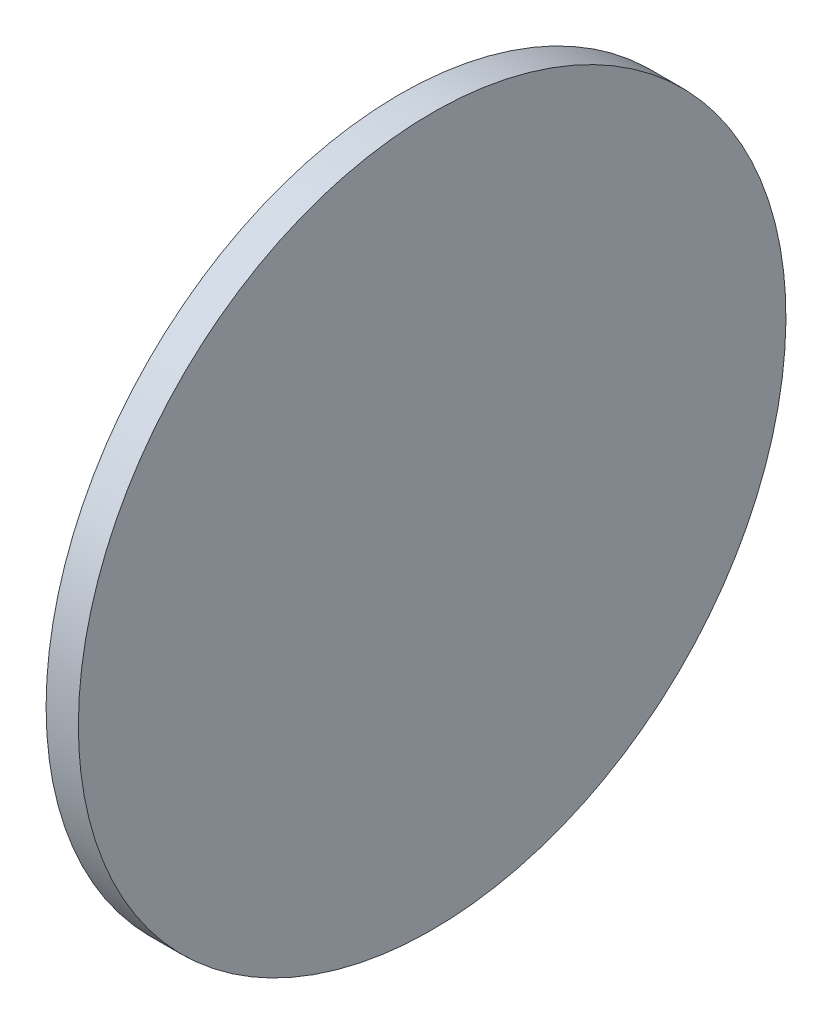
ISO-10303-21;
HEADER;
FILE_DESCRIPTION(('STEP AP214'),'2;1');
FILE_NAME('part.step','',(''),(''),'','','');
FILE_SCHEMA(('AUTOMOTIVE_DESIGN { 1 0 10303 214 1 1 1 1 }'));
ENDSEC;
DATA;
#1=APPLICATION_CONTEXT('core data for automotive mechanical design processes');
#2=APPLICATION_PROTOCOL_DEFINITION('international standard','automotive_design',2000,#1);
#3=PRODUCT_CONTEXT('',#1,'mechanical');
#4=PRODUCT('Part','Part','',(#3));
#5=PRODUCT_RELATED_PRODUCT_CATEGORY('part','',(#4));
#6=PRODUCT_DEFINITION_FORMATION('','',#4);
#7=PRODUCT_DEFINITION_CONTEXT('part definition',#1,'design');
#8=PRODUCT_DEFINITION('design','',#6,#7);
#9=PRODUCT_DEFINITION_SHAPE('','',#8);
#10=(LENGTH_UNIT() NAMED_UNIT(*) SI_UNIT(.MILLI.,.METRE.));
#11=(NAMED_UNIT(*) PLANE_ANGLE_UNIT() SI_UNIT($,.RADIAN.));
#12=(NAMED_UNIT(*) SI_UNIT($,.STERADIAN.) SOLID_ANGLE_UNIT());
#13=UNCERTAINTY_MEASURE_WITH_UNIT(LENGTH_MEASURE(1.E-05),#10,'distance_accuracy_value','');
#14=(GEOMETRIC_REPRESENTATION_CONTEXT(3) GLOBAL_UNCERTAINTY_ASSIGNED_CONTEXT((#13)) GLOBAL_UNIT_ASSIGNED_CONTEXT((#10,
#11,#12)) REPRESENTATION_CONTEXT('',''));
#15=CARTESIAN_POINT('',(0.,0.,0.));
#16=DIRECTION('',(0.,0.,1.));
#17=DIRECTION('',(1.,0.,0.));
#18=AXIS2_PLACEMENT_3D('',#15,#16,#17);
#19=CARTESIAN_POINT('',(-284.033268583936,22.6971380761825,594.411104985507));
#20=CARTESIAN_POINT('',(-284.033268583936,24.6488522827371,594.411104985507));
#21=CARTESIAN_POINT('',(-284.033268583936,28.5522806958463,594.026650843195));
#22=CARTESIAN_POINT('',(-284.033268583936,34.1824134682382,592.318768738421));
#23=CARTESIAN_POINT('',(-284.033268583936,39.3711735483301,589.545318693835));
#24=CARTESIAN_POINT('',(-284.033268583936,43.9191597961341,585.812882839282));
#25=CARTESIAN_POINT('',(-284.033268583936,47.6515956506874,581.264896591478));
#26=CARTESIAN_POINT('',(-284.033268583936,50.4250456952734,576.076136511386));
#27=CARTESIAN_POINT('',(-284.033268583936,52.1329278000475,570.446003738994));
#28=CARTESIAN_POINT('',(-284.033268583936,52.7096090135146,564.59086111933));
#29=CARTESIAN_POINT('',(-284.033268583936,52.1329278000475,558.735718499666));
#30=CARTESIAN_POINT('',(-284.033268583936,50.4250456952734,553.105585727274));
#31=CARTESIAN_POINT('',(-284.033268583936,47.6515956506874,547.916825647182));
#32=CARTESIAN_POINT('',(-284.033268583936,43.9191597961341,543.368839399378));
#33=CARTESIAN_POINT('',(-284.033268583936,39.3711735483301,539.636403544825));
#34=CARTESIAN_POINT('',(-284.033268583936,34.1824134682382,536.862953500239));
#35=CARTESIAN_POINT('',(-284.033268583936,28.5522806958463,535.155071395465));
#36=CARTESIAN_POINT('',(-284.033268583936,22.6971380761825,534.578390181998));
#37=CARTESIAN_POINT('',(-284.033268583936,16.8419954565187,535.155071395465));
#38=CARTESIAN_POINT('',(-284.033268583936,11.2118626841268,536.862953500239));
#39=CARTESIAN_POINT('',(-284.033268583936,6.02310260403487,539.636403544825));
#40=CARTESIAN_POINT('',(-284.033268583936,1.47511635623081,543.368839399378));
#41=CARTESIAN_POINT('',(-284.033268583936,-2.25731949832241,547.916825647182));
#42=CARTESIAN_POINT('',(-284.033268583936,-5.03076954290846,553.105585727274));
#43=CARTESIAN_POINT('',(-284.033268583936,-6.73865164768254,558.735718499666));
#44=CARTESIAN_POINT('',(-284.033268583936,-7.31533286114959,564.59086111933));
#45=CARTESIAN_POINT('',(-284.033268583936,-6.73865164768255,570.446003738994));
#46=CARTESIAN_POINT('',(-284.033268583936,-5.03076954290847,576.076136511386));
#47=CARTESIAN_POINT('',(-284.033268583936,-2.25731949832241,581.264896591478));
#48=CARTESIAN_POINT('',(-284.033268583936,1.4751163562308,585.812882839282));
#49=CARTESIAN_POINT('',(-284.033268583936,6.02310260403486,589.545318693835));
#50=CARTESIAN_POINT('',(-284.033268583936,11.2118626841268,592.318768738421));
#51=CARTESIAN_POINT('',(-284.033268583936,16.8419954565186,594.026650843195));
#52=CARTESIAN_POINT('',(-284.033268583936,20.7454238696279,594.411104985507));
#53=CARTESIAN_POINT('',(-284.033268583936,22.6971380761825,594.411104985507));
#54=B_SPLINE_CURVE_WITH_KNOTS('',3,(#19,#20,#21,#22,#23,#24,#25,#26,#27,#28,#29,#30,#31,#32,#33,
#34,#35,#36,#37,#38,#39,#40,#41,#42,#43,#44,#45,#46,#47,#48,#49,#50,#51,#52,#53),.UNSPECIFIED.,
.T.,.F.,(4,1,1,1,1,1,1,1,1,1,1,1,1,1,1,1,1,1,1,1,1,1,1,1,1,1,1,1,1,1,1,1,4),(0.,0.03125,
0.0625000000000001,0.09375,0.125,0.15625,0.1875,0.21875,0.25,0.28125,0.3125,0.34375,0.375,
0.40625,0.4375,0.46875,0.5,0.53125,0.5625,0.59375,0.625,0.65625,0.6875,0.71875,0.75,0.78125,
0.8125,0.84375,0.875,0.90625,0.9375,0.96875,1.),.UNSPECIFIED.);
#55=DIRECTION('',(-1.,0.,0.));
#56=VECTOR('',#55,1.);
#57=SURFACE_OF_LINEAR_EXTRUSION('',#54,#56);
#58=CARTESIAN_POINT('',(-284.033268583936,22.6971380761825,594.411104985507));
#59=CARTESIAN_POINT('',(-284.033268583936,24.6488522827371,594.411104985507));
#60=CARTESIAN_POINT('',(-284.033268583936,28.5522806958463,594.026650843195));
#61=CARTESIAN_POINT('',(-284.033268583936,34.1824134682382,592.318768738421));
#62=CARTESIAN_POINT('',(-284.033268583936,39.3711735483301,589.545318693835));
#63=CARTESIAN_POINT('',(-284.033268583936,43.9191597961341,585.812882839282));
#64=CARTESIAN_POINT('',(-284.033268583936,47.6515956506874,581.264896591478));
#65=CARTESIAN_POINT('',(-284.033268583936,50.4250456952734,576.076136511386));
#66=CARTESIAN_POINT('',(-284.033268583936,52.1329278000475,570.446003738994));
#67=CARTESIAN_POINT('',(-284.033268583936,52.7096090135146,564.59086111933));
#68=CARTESIAN_POINT('',(-284.033268583936,52.1329278000475,558.735718499666));
#69=CARTESIAN_POINT('',(-284.033268583936,50.4250456952734,553.105585727274));
#70=CARTESIAN_POINT('',(-284.033268583936,47.6515956506874,547.916825647182));
#71=CARTESIAN_POINT('',(-284.033268583936,43.9191597961341,543.368839399378));
#72=CARTESIAN_POINT('',(-284.033268583936,39.3711735483301,539.636403544825));
#73=CARTESIAN_POINT('',(-284.033268583936,34.1824134682382,536.862953500239));
#74=CARTESIAN_POINT('',(-284.033268583936,28.5522806958463,535.155071395465));
#75=CARTESIAN_POINT('',(-284.033268583936,22.6971380761825,534.578390181998));
#76=CARTESIAN_POINT('',(-284.033268583936,16.8419954565187,535.155071395465));
#77=CARTESIAN_POINT('',(-284.033268583936,11.2118626841268,536.862953500239));
#78=CARTESIAN_POINT('',(-284.033268583936,6.02310260403487,539.636403544825));
#79=CARTESIAN_POINT('',(-284.033268583936,1.47511635623081,543.368839399378));
#80=CARTESIAN_POINT('',(-284.033268583936,-2.25731949832241,547.916825647182));
#81=CARTESIAN_POINT('',(-284.033268583936,-5.03076954290846,553.105585727274));
#82=CARTESIAN_POINT('',(-284.033268583936,-6.73865164768254,558.735718499666));
#83=CARTESIAN_POINT('',(-284.033268583936,-7.31533286114959,564.59086111933));
#84=CARTESIAN_POINT('',(-284.033268583936,-6.73865164768255,570.446003738994));
#85=CARTESIAN_POINT('',(-284.033268583936,-5.03076954290847,576.076136511386));
#86=CARTESIAN_POINT('',(-284.033268583936,-2.25731949832241,581.264896591478));
#87=CARTESIAN_POINT('',(-284.033268583936,1.4751163562308,585.812882839282));
#88=CARTESIAN_POINT('',(-284.033268583936,6.02310260403486,589.545318693835));
#89=CARTESIAN_POINT('',(-284.033268583936,11.2118626841268,592.318768738421));
#90=CARTESIAN_POINT('',(-284.033268583936,16.8419954565186,594.026650843195));
#91=CARTESIAN_POINT('',(-284.033268583936,20.7454238696279,594.411104985507));
#92=CARTESIAN_POINT('',(-284.033268583936,22.6971380761825,594.411104985507));
#93=B_SPLINE_CURVE_WITH_KNOTS('',3,(#58,#59,#60,#61,#62,#63,#64,#65,#66,#67,#68,#69,#70,#71,#72,
#73,#74,#75,#76,#77,#78,#79,#80,#81,#82,#83,#84,#85,#86,#87,#88,#89,#90,#91,#92),.UNSPECIFIED.,
.T.,.F.,(4,1,1,1,1,1,1,1,1,1,1,1,1,1,1,1,1,1,1,1,1,1,1,1,1,1,1,1,1,1,1,1,4),(0.,0.03125,
0.0625000000000001,0.09375,0.125,0.15625,0.1875,0.21875,0.25,0.28125,0.3125,0.34375,0.375,
0.40625,0.4375,0.46875,0.5,0.53125,0.5625,0.59375,0.625,0.65625,0.6875,0.71875,0.75,0.78125,
0.8125,0.84375,0.875,0.90625,0.9375,0.96875,1.),.UNSPECIFIED.);
#94=CARTESIAN_POINT('',(-284.033268583936,22.6971380761825,594.411104985507));
#95=VERTEX_POINT('',#94);
#96=EDGE_CURVE('E9',#95,#95,#93,.T.);
#97=ORIENTED_EDGE('',*,*,#96,.T.);
#98=EDGE_LOOP('',(#97));
#99=FACE_BOUND('',#98,.T.);
#100=CARTESIAN_POINT('',(-286.754540547893,22.6971380761825,594.411104985507));
#101=CARTESIAN_POINT('',(-286.754540547893,22.209206528486,594.411104884299));
#102=CARTESIAN_POINT('',(-286.754540547892,21.7212785318932,594.39909065008));
#103=CARTESIAN_POINT('',(-286.754540547892,20.746594451324,594.351149407714));
#104=CARTESIAN_POINT('',(-286.754540547892,20.2598383764804,594.315222213816));
#105=CARTESIAN_POINT('',(-286.754540547892,19.2886705665238,594.219570547781));
#106=CARTESIAN_POINT('',(-286.754540547892,18.8042588314108,594.159846075645));
#107=CARTESIAN_POINT('',(-286.754540547892,17.8389491504251,594.016714552078));
#108=CARTESIAN_POINT('',(-286.754540547892,17.358051177287,593.933307684614));
#109=CARTESIAN_POINT('',(-286.754540547892,16.4009430181743,593.742927038007));
#110=CARTESIAN_POINT('',(-286.754540547892,15.9247328321996,593.635953258865));
#111=CARTESIAN_POINT('',(-286.754540547892,14.9781288439775,593.39878149562));
#112=CARTESIAN_POINT('',(-286.754540547892,14.5077350869397,593.26858333112));
#113=CARTESIAN_POINT('',(-286.754540547892,13.5738889928545,592.985304215865));
#114=CARTESIAN_POINT('',(-286.754540547892,13.1104366558071,592.83222326511));
#115=CARTESIAN_POINT('',(-286.754540547892,12.1915986284864,592.503519377936));
#116=CARTESIAN_POINT('',(-286.754540547892,11.7362128755807,592.32789661663));
#117=CARTESIAN_POINT('',(-286.754540547892,10.8346367234395,591.954451546941));
#118=CARTESIAN_POINT('',(-286.754540547892,10.388446324204,591.756629238558));
#119=CARTESIAN_POINT('',(-286.754540547892,9.50630097637825,591.339341385978));
#120=CARTESIAN_POINT('',(-286.754540547893,9.07034610732268,591.119875673671));
#121=CARTESIAN_POINT('',(-286.754540547893,8.20970861936342,590.659855352344));
#122=CARTESIAN_POINT('',(-286.754540547892,7.78502600045973,590.419300743324));
#123=CARTESIAN_POINT('',(-286.754540547892,6.94797013499261,589.917656402443));
#124=CARTESIAN_POINT('',(-286.754540547892,6.53559679283771,589.65656683011));
#125=CARTESIAN_POINT('',(-286.754540547892,5.72419969266131,589.114408620903));
#126=CARTESIAN_POINT('',(-286.754540547893,5.32517593463981,588.833339984029));
#127=CARTESIAN_POINT('',(-286.754540547893,4.54138958382109,588.251972180548));
#128=CARTESIAN_POINT('',(-286.754540547892,4.15662710182708,587.951672864578));
#129=CARTESIAN_POINT('',(-286.754540547892,3.40227203450267,587.332589660071));
#130=CARTESIAN_POINT('',(-286.754540547892,3.03267944917227,587.013805771534));
#131=CARTESIAN_POINT('',(-286.754540547892,2.30957333344485,586.35849888766));
#132=CARTESIAN_POINT('',(-286.754540547892,1.9560596781708,586.021976030138));
#133=CARTESIAN_POINT('',(-286.754540547892,1.26602316537438,585.331939517342));
#134=CARTESIAN_POINT('',(-286.754540547892,0.92950030785201,584.978425862068));
#135=CARTESIAN_POINT('',(-286.754540547892,0.274193423978801,584.25531974634));
#136=CARTESIAN_POINT('',(-286.754540547892,-0.044590464558481,583.88572716101));
#137=CARTESIAN_POINT('',(-286.754540547892,-0.663673669065746,583.131372093685));
#138=CARTESIAN_POINT('',(-286.754540547892,-0.963972985035729,582.746609611691));
#139=CARTESIAN_POINT('',(-286.754540547892,-1.54534078851652,581.962823260873));
#140=CARTESIAN_POINT('',(-286.754540547892,-1.82640942539097,581.563799502851));
#141=CARTESIAN_POINT('',(-286.754540547892,-2.36856763459814,580.752402402675));
#142=CARTESIAN_POINT('',(-286.754540547892,-2.62965720693085,580.340029060521));
#143=CARTESIAN_POINT('',(-286.754540547892,-3.13130154781153,579.502973195052));
#144=CARTESIAN_POINT('',(-286.754540547893,-3.37185615683169,579.078290576145));
#145=CARTESIAN_POINT('',(-286.754540547893,-3.83187647815844,578.217653088194));
#146=CARTESIAN_POINT('',(-286.754540547893,-4.05134219046503,577.781698219149));
#147=CARTESIAN_POINT('',(-286.754540547893,-4.46863004304626,576.899552871294));
#148=CARTESIAN_POINT('',(-286.754540547893,-4.6664523514312,576.453362472018));
#149=CARTESIAN_POINT('',(-286.754540547893,-5.0398974211151,575.551786319986));
#150=CARTESIAN_POINT('',(-286.754540547893,-5.21552018241406,575.096400567229));
#151=CARTESIAN_POINT('',(-286.754540547893,-5.54422406960752,574.177562539502));
#152=CARTESIAN_POINT('',(-286.754540547893,-5.69730502039051,573.714110201899));
#153=CARTESIAN_POINT('',(-286.754540547893,-5.98058413557056,572.780264109332));
#154=CARTESIAN_POINT('',(-286.754540547893,-6.11078229996761,572.309870354367));
#155=CARTESIAN_POINT('',(-286.754540547893,-6.3479540634923,571.363266360481));
#156=CARTESIAN_POINT('',(-286.754540547893,-6.4549278430165,570.88705616677));
#157=CARTESIAN_POINT('',(-286.754540547893,-6.64530848857959,569.929948028794));
#158=CARTESIAN_POINT('',(-286.754540547892,-6.72871535461848,569.44905008453));
#159=CARTESIAN_POINT('',(-286.754540547892,-6.87184688207915,568.483740324659));
#160=CARTESIAN_POINT('',(-286.754540547893,-6.93157135953518,567.999328481787));
#161=CARTESIAN_POINT('',(-286.754540547893,-7.02722301103691,567.028160966234));
#162=CARTESIAN_POINT('',(-286.754540547892,-7.06315018508261,566.541405293553));
#163=CARTESIAN_POINT('',(-286.754540547892,-7.11109148168596,565.566720114259));
#164=CARTESIAN_POINT('',(-286.754540547892,-7.12310578999391,565.078790616795));
#165=CARTESIAN_POINT('',(-286.754540547892,-7.12310578999391,564.102931621865));
#166=CARTESIAN_POINT('',(-286.754540547892,-7.11109148168596,563.615002124401));
#167=CARTESIAN_POINT('',(-286.754540547892,-7.06315018508261,562.640316945107));
#168=CARTESIAN_POINT('',(-286.754540547892,-7.02722301103691,562.153561272426));
#169=CARTESIAN_POINT('',(-286.754540547892,-6.93157135953518,561.182393756873));
#170=CARTESIAN_POINT('',(-286.754540547892,-6.87184688207915,560.697981914001));
#171=CARTESIAN_POINT('',(-286.754540547892,-6.72871535461848,559.73267215413));
#172=CARTESIAN_POINT('',(-286.754540547892,-6.64530848857958,559.251774209866));
#173=CARTESIAN_POINT('',(-286.754540547892,-6.45492784301649,558.29466607189));
#174=CARTESIAN_POINT('',(-286.754540547892,-6.34795406349228,557.818455878179));
#175=CARTESIAN_POINT('',(-286.754540547892,-6.1107822999676,556.871851884293));
#176=CARTESIAN_POINT('',(-286.754540547892,-5.98058413557056,556.401458129328));
#177=CARTESIAN_POINT('',(-286.754540547892,-5.69730502039051,555.467612036761));
#178=CARTESIAN_POINT('',(-286.754540547892,-5.5442240696075,555.004159699158));
#179=CARTESIAN_POINT('',(-286.754540547892,-5.21552018241404,554.085321671431));
#180=CARTESIAN_POINT('',(-286.754540547892,-5.03989742111507,553.629935918674));
#181=CARTESIAN_POINT('',(-286.754540547892,-4.6664523514312,552.728359766641));
#182=CARTESIAN_POINT('',(-286.754540547892,-4.46863004304629,552.282169367366));
#183=CARTESIAN_POINT('',(-286.754540547892,-4.05134219046503,551.400024019511));
#184=CARTESIAN_POINT('',(-286.754540547892,-3.8318764781584,550.964069150466));
#185=CARTESIAN_POINT('',(-286.754540547892,-3.37185615683165,550.103431662515));
#186=CARTESIAN_POINT('',(-286.754540547892,-3.13130154781152,549.678749043608));
#187=CARTESIAN_POINT('',(-286.754540547892,-2.62965720693086,548.841693178139));
#188=CARTESIAN_POINT('',(-286.754540547893,-2.36856763459813,548.429319835985));
#189=CARTESIAN_POINT('',(-286.754540547893,-1.82640942539096,547.617922735809));
#190=CARTESIAN_POINT('',(-286.754540547892,-1.54534078851652,547.218898977787));
#191=CARTESIAN_POINT('',(-286.754540547892,-0.963972985035716,546.435112626969));
#192=CARTESIAN_POINT('',(-286.754540547892,-0.663673669065712,546.050350144975));
#193=CARTESIAN_POINT('',(-286.754540547892,-0.0445904645584666,545.29599507765));
#194=CARTESIAN_POINT('',(-286.754540547892,0.274193423978776,544.92640249232));
#195=CARTESIAN_POINT('',(-286.754540547892,0.929500307851993,544.203296376592));
#196=CARTESIAN_POINT('',(-286.754540547892,1.26602316537441,543.849782721318));
#197=CARTESIAN_POINT('',(-286.754540547892,1.95605967817082,543.159746208522));
#198=CARTESIAN_POINT('',(-286.754540547892,2.30957333344482,542.823223350999));
#199=CARTESIAN_POINT('',(-286.754540547892,3.03267944917226,542.167916467126));
#200=CARTESIAN_POINT('',(-286.754540547892,3.40227203450272,541.849132578589));
#201=CARTESIAN_POINT('',(-286.754540547892,4.1566271018271,541.230049374082));
#202=CARTESIAN_POINT('',(-286.754540547893,4.54138958382102,540.929750058112));
#203=CARTESIAN_POINT('',(-286.754540547893,5.32517593463987,540.348382254631));
#204=CARTESIAN_POINT('',(-286.754540547893,5.7241996926616,540.067313617757));
#205=CARTESIAN_POINT('',(-286.754540547893,6.53559679283744,539.525155408549));
#206=CARTESIAN_POINT('',(-286.754540547893,6.94797013499156,539.264065836217));
#207=CARTESIAN_POINT('',(-286.754540547893,7.78502600046078,538.762421495336));
#208=CARTESIAN_POINT('',(-286.754540547893,8.20970861936735,538.521866886316));
#209=CARTESIAN_POINT('',(-286.754540547893,9.0703461073188,538.061846564989));
#210=CARTESIAN_POINT('',(-286.754540547892,9.50630097636368,537.842380852683));
#211=CARTESIAN_POINT('',(-286.754540547892,10.3884463242187,537.425093000101));
#212=CARTESIAN_POINT('',(-286.754540547892,10.834636723494,537.227270691716));
#213=CARTESIAN_POINT('',(-286.754540547892,11.7362128755262,536.853825622032));
#214=CARTESIAN_POINT('',(-286.754540547892,12.1915986282831,536.678202860733));
#215=CARTESIAN_POINT('',(-286.754540547892,13.1104366560105,536.34949897354));
#216=CARTESIAN_POINT('',(-286.754540547892,13.5738889936134,536.196418022757));
#217=CARTESIAN_POINT('',(-286.754540547892,14.5077350861809,535.913138907577));
#218=CARTESIAN_POINT('',(-286.754540547892,14.9781288411457,535.78294074318));
#219=CARTESIAN_POINT('',(-286.754540547892,15.9247328350315,535.545768979655));
#220=CARTESIAN_POINT('',(-286.754540547892,16.4009430287428,535.438795200131));
#221=CARTESIAN_POINT('',(-286.754540547892,17.3580511667186,535.248414554568));
#222=CARTESIAN_POINT('',(-286.754540547892,17.838949110983,535.165007688529));
#223=CARTESIAN_POINT('',(-286.754540547892,18.8042588708533,535.021876161068));
#224=CARTESIAN_POINT('',(-286.754540547892,19.2886707137254,534.962151683612));
#225=CARTESIAN_POINT('',(-286.754540547892,20.2598382292787,534.86650003211));
#226=CARTESIAN_POINT('',(-286.754540547892,20.7465939019599,534.830572858065));
#227=CARTESIAN_POINT('',(-286.754540547892,21.7212790812532,534.782631561462));
#228=CARTESIAN_POINT('',(-286.754540547892,22.2092085787178,534.770617253154));
#229=CARTESIAN_POINT('',(-286.754540547892,23.1850675736471,534.770617253154));
#230=CARTESIAN_POINT('',(-286.754540547892,23.6729970711118,534.782631561462));
#231=CARTESIAN_POINT('',(-286.754540547892,24.6476822504051,534.830572858065));
#232=CARTESIAN_POINT('',(-286.754540547893,25.1344379230863,534.86650003211));
#233=CARTESIAN_POINT('',(-286.754540547893,26.1056054386395,534.962151683612));
#234=CARTESIAN_POINT('',(-286.754540547893,26.5900172815117,535.021876161068));
#235=CARTESIAN_POINT('',(-286.754540547892,27.555327041382,535.165007688529));
#236=CARTESIAN_POINT('',(-286.754540547892,28.0362249856464,535.248414554568));
#237=CARTESIAN_POINT('',(-286.754540547892,28.9933331236222,535.438795200131));
#238=CARTESIAN_POINT('',(-286.754540547892,29.4695433173335,535.545768979655));
#239=CARTESIAN_POINT('',(-286.754540547892,30.4161473112193,535.78294074318));
#240=CARTESIAN_POINT('',(-286.754540547892,30.8865410661841,535.913138907577));
#241=CARTESIAN_POINT('',(-286.754540547892,31.8203871587516,536.196418022757));
#242=CARTESIAN_POINT('',(-286.754540547892,32.2838394963545,536.34949897354));
#243=CARTESIAN_POINT('',(-286.754540547892,33.2026775240819,536.678202860734));
#244=CARTESIAN_POINT('',(-286.754540547892,33.6580632768388,536.853825622032));
#245=CARTESIAN_POINT('',(-286.754540547892,34.559639428871,537.227270691716));
#246=CARTESIAN_POINT('',(-286.754540547892,35.0058298281463,537.425093000101));
#247=CARTESIAN_POINT('',(-286.754540547892,35.8879751760013,537.842380852683));
#248=CARTESIAN_POINT('',(-286.754540547892,36.3239300450462,538.061846564989));
#249=CARTESIAN_POINT('',(-286.754540547892,37.1845675329976,538.521866886316));
#250=CARTESIAN_POINT('',(-286.754540547893,37.6092501519042,538.762421495336));
#251=CARTESIAN_POINT('',(-286.754540547893,38.4463060173734,539.264065836217));
#252=CARTESIAN_POINT('',(-286.754540547893,38.8586793595276,539.525155408549));
#253=CARTESIAN_POINT('',(-286.754540547893,39.6700764597034,540.067313617757));
#254=CARTESIAN_POINT('',(-286.754540547893,40.0691002177251,540.348382254631));
#255=CARTESIAN_POINT('',(-286.754540547893,40.8528865685439,540.929750058112));
#256=CARTESIAN_POINT('',(-286.754540547893,41.2376490505379,541.230049374082));
#257=CARTESIAN_POINT('',(-286.754540547893,41.9920041178623,541.849132578589));
#258=CARTESIAN_POINT('',(-286.754540547893,42.3615967031927,542.167916467126));
#259=CARTESIAN_POINT('',(-286.754540547893,43.0847028189201,542.823223351));
#260=CARTESIAN_POINT('',(-286.754540547893,43.4382164741942,543.159746208522));
#261=CARTESIAN_POINT('',(-286.754540547893,44.1282529869906,543.849782721318));
#262=CARTESIAN_POINT('',(-286.754540547892,44.4647758445129,544.203296376592));
#263=CARTESIAN_POINT('',(-286.754540547892,45.1200827283862,544.92640249232));
#264=CARTESIAN_POINT('',(-286.754540547892,45.4388666169235,545.29599507765));
#265=CARTESIAN_POINT('',(-286.754540547892,46.0579498214307,546.050350144974));
#266=CARTESIAN_POINT('',(-286.754540547892,46.3582491374007,546.435112626969));
#267=CARTESIAN_POINT('',(-286.754540547892,46.9396169408815,547.218898977787));
#268=CARTESIAN_POINT('',(-286.754540547892,47.220685577756,547.617922735809));
#269=CARTESIAN_POINT('',(-286.754540547892,47.7628437869631,548.429319835985));
#270=CARTESIAN_POINT('',(-286.754540547892,48.0239333592958,548.841693178139));
#271=CARTESIAN_POINT('',(-286.754540547892,48.5255777001764,549.678749043608));
#272=CARTESIAN_POINT('',(-286.754540547892,48.7661323091966,550.103431662515));
#273=CARTESIAN_POINT('',(-286.754540547892,49.2261526305234,550.964069150466));
#274=CARTESIAN_POINT('',(-286.754540547892,49.44561834283,551.400024019511));
#275=CARTESIAN_POINT('',(-286.754540547892,49.8629061954112,552.282169367366));
#276=CARTESIAN_POINT('',(-286.754540547892,50.0607285037961,552.728359766642));
#277=CARTESIAN_POINT('',(-286.754540547892,50.43417357348,553.629935918674));
#278=CARTESIAN_POINT('',(-286.754540547892,50.609796334779,554.085321671431));
#279=CARTESIAN_POINT('',(-286.754540547892,50.9385002219725,555.004159699158));
#280=CARTESIAN_POINT('',(-286.754540547892,51.0915811727554,555.467612036761));
#281=CARTESIAN_POINT('',(-286.754540547892,51.3748602879355,556.401458129328));
#282=CARTESIAN_POINT('',(-286.754540547892,51.5050584523326,556.871851884293));
#283=CARTESIAN_POINT('',(-286.754540547893,51.7422302158573,557.818455878179));
#284=CARTESIAN_POINT('',(-286.754540547893,51.8492039953815,558.29466607189));
#285=CARTESIAN_POINT('',(-286.754540547893,52.0395846409446,559.251774209866));
#286=CARTESIAN_POINT('',(-286.754540547892,52.1229915069834,559.73267215413));
#287=CARTESIAN_POINT('',(-286.754540547892,52.2661230344441,560.697981914001));
#288=CARTESIAN_POINT('',(-286.754540547893,52.3258475119002,561.182393756873));
#289=CARTESIAN_POINT('',(-286.754540547893,52.4214991634019,562.153561272426));
#290=CARTESIAN_POINT('',(-286.754540547893,52.4574263374476,562.640316945107));
#291=CARTESIAN_POINT('',(-286.754540547893,52.5053676340509,563.615002124401));
#292=CARTESIAN_POINT('',(-286.754540547893,52.5173819423589,564.102931621865));
#293=CARTESIAN_POINT('',(-286.754540547893,52.5173819423589,565.078790616795));
#294=CARTESIAN_POINT('',(-286.754540547893,52.5053676340509,565.566720114259));
#295=CARTESIAN_POINT('',(-286.754540547893,52.4574263374476,566.541405293553));
#296=CARTESIAN_POINT('',(-286.754540547893,52.4214991634019,567.028160966234));
#297=CARTESIAN_POINT('',(-286.754540547893,52.3258475119001,567.999328481787));
#298=CARTESIAN_POINT('',(-286.754540547893,52.2661230344441,568.483740324659));
#299=CARTESIAN_POINT('',(-286.754540547893,52.1229915069834,569.44905008453));
#300=CARTESIAN_POINT('',(-286.754540547892,52.0395846409445,569.929948028794));
#301=CARTESIAN_POINT('',(-286.754540547892,51.8492039953814,570.88705616677));
#302=CARTESIAN_POINT('',(-286.754540547892,51.7422302158573,571.363266360481));
#303=CARTESIAN_POINT('',(-286.754540547892,51.5050584523326,572.309870354367));
#304=CARTESIAN_POINT('',(-286.754540547892,51.3748602879355,572.780264109332));
#305=CARTESIAN_POINT('',(-286.754540547892,51.0915811727555,573.714110201899));
#306=CARTESIAN_POINT('',(-286.754540547892,50.9385002219724,574.177562539502));
#307=CARTESIAN_POINT('',(-286.754540547892,50.609796334779,575.096400567229));
#308=CARTESIAN_POINT('',(-286.754540547892,50.43417357348,575.551786319986));
#309=CARTESIAN_POINT('',(-286.754540547892,50.0607285037962,576.453362472018));
#310=CARTESIAN_POINT('',(-286.754540547892,49.8629061954112,576.899552871294));
#311=CARTESIAN_POINT('',(-286.754540547892,49.44561834283,577.781698219149));
#312=CARTESIAN_POINT('',(-286.754540547893,49.2261526305234,578.217653088194));
#313=CARTESIAN_POINT('',(-286.754540547893,48.7661323091966,579.078290576145));
#314=CARTESIAN_POINT('',(-286.754540547893,48.5255777001764,579.502973195052));
#315=CARTESIAN_POINT('',(-286.754540547893,48.0239333592958,580.340029060521));
#316=CARTESIAN_POINT('',(-286.754540547893,47.7628437869631,580.752402402675));
#317=CARTESIAN_POINT('',(-286.754540547893,47.220685577756,581.563799502851));
#318=CARTESIAN_POINT('',(-286.754540547893,46.9396169408815,581.962823260873));
#319=CARTESIAN_POINT('',(-286.754540547893,46.3582491374007,582.746609611691));
#320=CARTESIAN_POINT('',(-286.754540547893,46.0579498214307,583.131372093685));
#321=CARTESIAN_POINT('',(-286.754540547893,45.4388666169234,583.88572716101));
#322=CARTESIAN_POINT('',(-286.754540547893,45.1200827283862,584.25531974634));
#323=CARTESIAN_POINT('',(-286.754540547893,44.464775844513,584.978425862068));
#324=CARTESIAN_POINT('',(-286.754540547892,44.1282529869905,585.331939517342));
#325=CARTESIAN_POINT('',(-286.754540547892,43.4382164741941,586.021976030138));
#326=CARTESIAN_POINT('',(-286.754540547892,43.0847028189201,586.35849888766));
#327=CARTESIAN_POINT('',(-286.754540547892,42.3615967031927,587.013805771534));
#328=CARTESIAN_POINT('',(-286.754540547892,41.9920041178623,587.332589660071));
#329=CARTESIAN_POINT('',(-286.754540547892,41.2376490505379,587.951672864578));
#330=CARTESIAN_POINT('',(-286.754540547892,40.8528865685438,588.251972180548));
#331=CARTESIAN_POINT('',(-286.754540547892,40.0691002177251,588.833339984029));
#332=CARTESIAN_POINT('',(-286.754540547892,39.6700764597036,589.114408620903));
#333=CARTESIAN_POINT('',(-286.754540547892,38.8586793595273,589.656566830111));
#334=CARTESIAN_POINT('',(-286.754540547892,38.4463060173724,589.917656402443));
#335=CARTESIAN_POINT('',(-286.754540547892,37.6092501519052,590.419300743324));
#336=CARTESIAN_POINT('',(-286.754540547892,37.1845675330015,590.659855352344));
#337=CARTESIAN_POINT('',(-286.754540547892,36.3239300450423,591.119875673671));
#338=CARTESIAN_POINT('',(-286.754540547892,35.8879751759867,591.339341385978));
#339=CARTESIAN_POINT('',(-286.754540547892,35.0058298281609,591.756629238558));
#340=CARTESIAN_POINT('',(-286.754540547892,34.5596394289255,591.954451546941));
#341=CARTESIAN_POINT('',(-286.754540547892,33.6580632767843,592.32789661663));
#342=CARTESIAN_POINT('',(-286.754540547892,33.2026775238785,592.503519377936));
#343=CARTESIAN_POINT('',(-286.754540547892,32.2838394965578,592.83222326511));
#344=CARTESIAN_POINT('',(-286.754540547892,31.8203871595104,592.985304215865));
#345=CARTESIAN_POINT('',(-286.754540547892,30.8865410654252,593.268583331121));
#346=CARTESIAN_POINT('',(-286.754540547892,30.4161473083875,593.39878149562));
#347=CARTESIAN_POINT('',(-286.754540547892,29.4695433201653,593.635953258865));
#348=CARTESIAN_POINT('',(-286.754540547892,28.9933331341907,593.742927038007));
#349=CARTESIAN_POINT('',(-286.754540547892,28.0362249750779,593.933307684614));
#350=CARTESIAN_POINT('',(-286.754540547892,27.5553270019398,594.016714552078));
#351=CARTESIAN_POINT('',(-286.754540547892,26.5900173209541,594.159846075645));
#352=CARTESIAN_POINT('',(-286.754540547892,26.1056055858412,594.219570547781));
#353=CARTESIAN_POINT('',(-286.754540547892,25.1344377758846,594.315222213816));
#354=CARTESIAN_POINT('',(-286.754540547892,24.6476817010409,594.351149407714));
#355=CARTESIAN_POINT('',(-286.754540547892,23.6729976204717,594.39909065008));
#356=CARTESIAN_POINT('',(-286.754540547892,23.185069623879,594.411104884299));
#357=CARTESIAN_POINT('',(-286.754540547893,22.6971380761825,594.411104985507));
#358=B_SPLINE_CURVE_WITH_KNOTS('',3,(#100,#101,#102,#103,#104,#105,#106,#107,#108,#109,#110,
#111,#112,#113,#114,#115,#116,#117,#118,#119,#120,#121,#122,#123,#124,#125,#126,#127,#128,#129,
#130,#131,#132,#133,#134,#135,#136,#137,#138,#139,#140,#141,#142,#143,#144,#145,#146,#147,#148,
#149,#150,#151,#152,#153,#154,#155,#156,#157,#158,#159,#160,#161,#162,#163,#164,#165,#166,#167,
#168,#169,#170,#171,#172,#173,#174,#175,#176,#177,#178,#179,#180,#181,#182,#183,#184,#185,#186,
#187,#188,#189,#190,#191,#192,#193,#194,#195,#196,#197,#198,#199,#200,#201,#202,#203,#204,#205,
#206,#207,#208,#209,#210,#211,#212,#213,#214,#215,#216,#217,#218,#219,#220,#221,#222,#223,#224,
#225,#226,#227,#228,#229,#230,#231,#232,#233,#234,#235,#236,#237,#238,#239,#240,#241,#242,#243,
#244,#245,#246,#247,#248,#249,#250,#251,#252,#253,#254,#255,#256,#257,#258,#259,#260,#261,#262,
#263,#264,#265,#266,#267,#268,#269,#270,#271,#272,#273,#274,#275,#276,#277,#278,#279,#280,#281,
#282,#283,#284,#285,#286,#287,#288,#289,#290,#291,#292,#293,#294,#295,#296,#297,#298,#299,#300,
#301,#302,#303,#304,#305,#306,#307,#308,#309,#310,#311,#312,#313,#314,#315,#316,#317,#318,#319,
#320,#321,#322,#323,#324,#325,#326,#327,#328,#329,#330,#331,#332,#333,#334,#335,#336,#337,#338,
#339,#340,#341,#342,#343,#344,#345,#346,#347,#348,#349,#350,#351,#352,#353,#354,#355,#356,#357),
.UNSPECIFIED.,.F.,.F.,(4,2,2,2,2,2,2,2,2,2,2,2,2,2,2,2,2,2,2,2,2,2,2,2,2,2,2,2,2,2,2,2,2,2,2,2,
2,2,2,2,2,2,2,2,2,2,2,2,2,2,2,2,2,2,2,2,2,2,2,2,2,2,2,2,2,2,2,2,2,2,2,2,2,2,2,2,2,2,2,2,2,2,2,2,
2,2,2,2,2,2,2,2,2,2,2,2,2,2,2,2,2,2,2,2,2,2,2,2,2,2,2,2,2,2,2,2,2,2,2,2,2,2,2,2,2,2,2,2,4),(0.,
1.4636421175969,2.92729560460172,4.39094909160655,5.85459120920346,7.31823332680033,
8.78188681380517,10.24554030081,11.7091824184069,13.1728245360038,14.6364780230085,
16.1001315100134,17.5637736276103,19.0274157452071,20.4910692322119,21.9547227192168,
23.4183648368136,24.8820069544106,26.3456604414154,27.8093139284202,29.2729560460171,
30.7365981636139,32.2002516506188,33.6639051376236,35.1275472552205,36.5911893728173,
38.0548428598221,39.5184963468269,40.9821384644239,42.4457805820207,43.9094340690256,
45.3730875560304,46.8367296736273,48.300371791224,49.764025278229,51.2276787652339,
52.6913208828307,54.1549630004277,55.6186164874325,57.0822699744373,58.5459120920341,
60.0095542096311,61.4732076966357,62.9368611836407,64.4005033012374,65.8641454188344,
67.3277989058392,68.7914523928441,70.255094510441,71.7187366280379,73.1823901150426,
74.6460436020475,76.1096857196443,77.5733278372412,79.036981324246,80.5006348112509,
81.9642769288478,83.4279190464447,84.8915725334495,86.3552260204543,87.8188681380512,
89.282510255648,90.7461637426529,92.2098172296577,93.6734593472546,95.1371014648515,
96.6007549518563,98.0644084388611,99.528050556458,100.991692674055,102.45534616106,
103.918999648065,105.382641765661,106.846283883258,108.309937370263,109.773590857268,
111.237232974865,112.700875092462,114.164528579467,115.628182066471,117.091824184068,
118.555466301665,120.01911978867,121.482773275675,122.946415393272,124.410057510868,
125.873710997873,127.337364484878,128.801006602475,130.264648720072,131.728302207077,
133.191955694081,134.655597811678,136.119239929275,137.58289341628,139.046546903285,
140.510189020882,141.973831138479,143.437484625484,144.901138112488,146.364780230085,
147.828422347682,149.292075834687,150.755729321692,152.219371439288,153.683013556885,
155.14666704389,156.610320530895,158.073962648492,159.537604766089,161.001258253094,
162.464911740099,163.928553857695,165.392195975292,166.855849462297,168.319502949302,
169.783145066899,171.246787184496,172.710440671501,174.174094158505,175.637736276102,
177.101378393699,178.565031880704,180.028685367709,181.492327485306,182.955969602903,
184.419623089907,185.883276576912,187.346918694509),.UNSPECIFIED.);
#359=CARTESIAN_POINT('',(-286.754540547893,22.6971380761825,594.411104985507));
#360=VERTEX_POINT('',#359);
#361=EDGE_CURVE('E24',#360,#360,#358,.F.);
#362=ORIENTED_EDGE('',*,*,#361,.F.);
#363=EDGE_LOOP('',(#362));
#364=FACE_BOUND('',#363,.T.);
#365=ADVANCED_FACE('F14',(#99,#364),#57,.T.);
#366=CARTESIAN_POINT('',(-284.033268583936,22.6971380761825,496.59086111933));
#367=DIRECTION('',(-1.,0.,0.));
#368=DIRECTION('',(0.,-1.,0.));
#369=AXIS2_PLACEMENT_3D('',#366,#367,#368);
#370=PLANE('',#369);
#371=ORIENTED_EDGE('',*,*,#96,.F.);
#372=EDGE_LOOP('',(#371));
#373=FACE_BOUND('',#372,.T.);
#374=ADVANCED_FACE('F62',(#373),#370,.F.);
#375=CARTESIAN_POINT('',(-286.754540547893,22.6971380761825,496.59086111933));
#376=DIRECTION('',(-1.,0.,0.));
#377=DIRECTION('',(0.,-1.,0.));
#378=AXIS2_PLACEMENT_3D('',#375,#376,#377);
#379=PLANE('',#378);
#380=ORIENTED_EDGE('',*,*,#361,.T.);
#381=EDGE_LOOP('',(#380));
#382=FACE_BOUND('',#381,.T.);
#383=ADVANCED_FACE('F31',(#382),#379,.T.);
#384=CLOSED_SHELL('',(#365,#374,#383));
#385=MANIFOLD_SOLID_BREP('B1',#384);
#386=ADVANCED_BREP_SHAPE_REPRESENTATION('',(#18,#385),#14);
#387=SHAPE_DEFINITION_REPRESENTATION(#9,#386);
ENDSEC;
END-ISO-10303-21;
